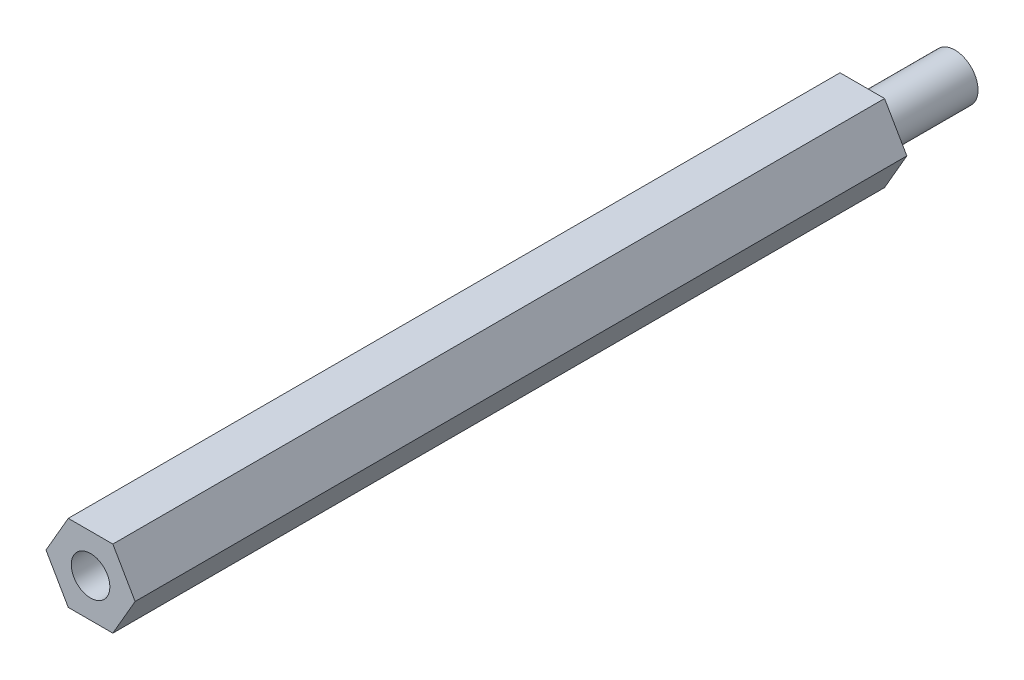
ISO-10303-21;
HEADER;
FILE_DESCRIPTION(('STEP AP214'),'2;1');
FILE_NAME('part.step','',(''),(''),'','','');
FILE_SCHEMA(('AUTOMOTIVE_DESIGN { 1 0 10303 214 1 1 1 1 }'));
ENDSEC;
DATA;
#1=APPLICATION_CONTEXT('core data for automotive mechanical design processes');
#2=APPLICATION_PROTOCOL_DEFINITION('international standard','automotive_design',2000,#1);
#3=PRODUCT_CONTEXT('',#1,'mechanical');
#4=PRODUCT('Part','Part','',(#3));
#5=PRODUCT_RELATED_PRODUCT_CATEGORY('part','',(#4));
#6=PRODUCT_DEFINITION_FORMATION('','',#4);
#7=PRODUCT_DEFINITION_CONTEXT('part definition',#1,'design');
#8=PRODUCT_DEFINITION('design','',#6,#7);
#9=PRODUCT_DEFINITION_SHAPE('','',#8);
#10=(LENGTH_UNIT() NAMED_UNIT(*) SI_UNIT(.MILLI.,.METRE.));
#11=(NAMED_UNIT(*) PLANE_ANGLE_UNIT() SI_UNIT($,.RADIAN.));
#12=(NAMED_UNIT(*) SI_UNIT($,.STERADIAN.) SOLID_ANGLE_UNIT());
#13=UNCERTAINTY_MEASURE_WITH_UNIT(LENGTH_MEASURE(1.E-05),#10,'distance_accuracy_value','');
#14=(GEOMETRIC_REPRESENTATION_CONTEXT(3) GLOBAL_UNCERTAINTY_ASSIGNED_CONTEXT((#13)) GLOBAL_UNIT_ASSIGNED_CONTEXT((#10,
#11,#12)) REPRESENTATION_CONTEXT('',''));
#15=CARTESIAN_POINT('',(0.,0.,0.));
#16=DIRECTION('',(0.,0.,1.));
#17=DIRECTION('',(1.,0.,0.));
#18=AXIS2_PLACEMENT_3D('',#15,#16,#17);
#19=CARTESIAN_POINT('',(1.44337567297406,2.5,50.));
#20=DIRECTION('',(0.,-1.,0.));
#21=DIRECTION('',(1.,0.,0.));
#22=AXIS2_PLACEMENT_3D('',#19,#20,#21);
#23=PLANE('',#22);
#24=DIRECTION('',(-1.,0.,0.));
#25=VECTOR('',#24,1.);
#26=CARTESIAN_POINT('',(1.44337567297406,2.5,0.));
#27=LINE('',#26,#25);
#28=CARTESIAN_POINT('',(1.44337567297406,2.5,0.));
#29=VERTEX_POINT('',#28);
#30=CARTESIAN_POINT('',(-1.44337567297407,2.5,0.));
#31=VERTEX_POINT('',#30);
#32=EDGE_CURVE('E132',#29,#31,#27,.T.);
#33=ORIENTED_EDGE('',*,*,#32,.T.);
#34=DIRECTION('',(0.,0.,-1.));
#35=VECTOR('',#34,1.);
#36=CARTESIAN_POINT('',(-1.44337567297407,2.5,50.));
#37=LINE('',#36,#35);
#38=CARTESIAN_POINT('',(-1.44337567297407,2.5,50.));
#39=VERTEX_POINT('',#38);
#40=EDGE_CURVE('E42',#39,#31,#37,.T.);
#41=ORIENTED_EDGE('',*,*,#40,.F.);
#42=DIRECTION('',(-1.,0.,0.));
#43=VECTOR('',#42,1.);
#44=CARTESIAN_POINT('',(1.44337567297406,2.5,50.));
#45=LINE('',#44,#43);
#46=CARTESIAN_POINT('',(1.44337567297406,2.5,50.));
#47=VERTEX_POINT('',#46);
#48=EDGE_CURVE('E149',#47,#39,#45,.T.);
#49=ORIENTED_EDGE('',*,*,#48,.F.);
#50=DIRECTION('',(0.,0.,-1.));
#51=VECTOR('',#50,1.);
#52=CARTESIAN_POINT('',(1.44337567297406,2.5,50.));
#53=LINE('',#52,#51);
#54=EDGE_CURVE('E128',#47,#29,#53,.T.);
#55=ORIENTED_EDGE('',*,*,#54,.T.);
#56=EDGE_LOOP('',(#33,#41,#49,#55));
#57=FACE_BOUND('',#56,.T.);
#58=ADVANCED_FACE('F39',(#57),#23,.F.);
#59=CARTESIAN_POINT('',(-1.44337567297407,2.5,50.));
#60=DIRECTION('',(0.866025403784439,-0.5,0.));
#61=DIRECTION('',(0.5,0.866025403784439,0.));
#62=AXIS2_PLACEMENT_3D('',#59,#60,#61);
#63=PLANE('',#62);
#64=DIRECTION('',(-0.5,-0.866025403784439,0.));
#65=VECTOR('',#64,1.);
#66=CARTESIAN_POINT('',(-1.44337567297407,2.5,0.));
#67=LINE('',#66,#65);
#68=CARTESIAN_POINT('',(-2.88675134594813,0.,0.));
#69=VERTEX_POINT('',#68);
#70=EDGE_CURVE('E136',#31,#69,#67,.T.);
#71=ORIENTED_EDGE('',*,*,#70,.T.);
#72=DIRECTION('',(0.,0.,-1.));
#73=VECTOR('',#72,1.);
#74=CARTESIAN_POINT('',(-2.88675134594813,0.,50.));
#75=LINE('',#74,#73);
#76=CARTESIAN_POINT('',(-2.88675134594813,0.,50.));
#77=VERTEX_POINT('',#76);
#78=EDGE_CURVE('E155',#77,#69,#75,.T.);
#79=ORIENTED_EDGE('',*,*,#78,.F.);
#80=DIRECTION('',(-0.5,-0.866025403784439,0.));
#81=VECTOR('',#80,1.);
#82=CARTESIAN_POINT('',(-1.44337567297407,2.5,50.));
#83=LINE('',#82,#81);
#84=EDGE_CURVE('E96',#39,#77,#83,.T.);
#85=ORIENTED_EDGE('',*,*,#84,.F.);
#86=ORIENTED_EDGE('',*,*,#40,.T.);
#87=EDGE_LOOP('',(#71,#79,#85,#86));
#88=FACE_BOUND('',#87,.T.);
#89=ADVANCED_FACE('F162',(#88),#63,.F.);
#90=CARTESIAN_POINT('',(-2.88675134594813,0.,50.));
#91=DIRECTION('',(0.866025403784438,0.5,0.));
#92=DIRECTION('',(-0.5,0.866025403784438,0.));
#93=AXIS2_PLACEMENT_3D('',#90,#91,#92);
#94=PLANE('',#93);
#95=DIRECTION('',(0.5,-0.866025403784438,0.));
#96=VECTOR('',#95,1.);
#97=CARTESIAN_POINT('',(-2.88675134594813,0.,0.));
#98=LINE('',#97,#96);
#99=CARTESIAN_POINT('',(-1.44337567297406,-2.5,0.));
#100=VERTEX_POINT('',#99);
#101=EDGE_CURVE('E140',#69,#100,#98,.T.);
#102=ORIENTED_EDGE('',*,*,#101,.T.);
#103=DIRECTION('',(0.,0.,-1.));
#104=VECTOR('',#103,1.);
#105=CARTESIAN_POINT('',(-1.44337567297406,-2.5,50.));
#106=LINE('',#105,#104);
#107=CARTESIAN_POINT('',(-1.44337567297406,-2.5,50.));
#108=VERTEX_POINT('',#107);
#109=EDGE_CURVE('E121',#108,#100,#106,.T.);
#110=ORIENTED_EDGE('',*,*,#109,.F.);
#111=DIRECTION('',(0.5,-0.866025403784438,0.));
#112=VECTOR('',#111,1.);
#113=CARTESIAN_POINT('',(-2.88675134594813,0.,50.));
#114=LINE('',#113,#112);
#115=EDGE_CURVE('E110',#77,#108,#114,.T.);
#116=ORIENTED_EDGE('',*,*,#115,.F.);
#117=ORIENTED_EDGE('',*,*,#78,.T.);
#118=EDGE_LOOP('',(#102,#110,#116,#117));
#119=FACE_BOUND('',#118,.T.);
#120=ADVANCED_FACE('F168',(#119),#94,.F.);
#121=CARTESIAN_POINT('',(-1.44337567297406,-2.5,50.));
#122=DIRECTION('',(0.,1.,0.));
#123=DIRECTION('',(-1.,0.,0.));
#124=AXIS2_PLACEMENT_3D('',#121,#122,#123);
#125=PLANE('',#124);
#126=DIRECTION('',(1.,0.,0.));
#127=VECTOR('',#126,1.);
#128=CARTESIAN_POINT('',(-1.44337567297406,-2.5,0.));
#129=LINE('',#128,#127);
#130=CARTESIAN_POINT('',(1.44337567297407,-2.5,0.));
#131=VERTEX_POINT('',#130);
#132=EDGE_CURVE('E119',#100,#131,#129,.T.);
#133=ORIENTED_EDGE('',*,*,#132,.T.);
#134=DIRECTION('',(0.,0.,-1.));
#135=VECTOR('',#134,1.);
#136=CARTESIAN_POINT('',(1.44337567297407,-2.5,50.));
#137=LINE('',#136,#135);
#138=CARTESIAN_POINT('',(1.44337567297407,-2.5,50.));
#139=VERTEX_POINT('',#138);
#140=EDGE_CURVE('E116',#139,#131,#137,.T.);
#141=ORIENTED_EDGE('',*,*,#140,.F.);
#142=DIRECTION('',(1.,0.,0.));
#143=VECTOR('',#142,1.);
#144=CARTESIAN_POINT('',(-1.44337567297406,-2.5,50.));
#145=LINE('',#144,#143);
#146=EDGE_CURVE('E104',#108,#139,#145,.T.);
#147=ORIENTED_EDGE('',*,*,#146,.F.);
#148=ORIENTED_EDGE('',*,*,#109,.T.);
#149=EDGE_LOOP('',(#133,#141,#147,#148));
#150=FACE_BOUND('',#149,.T.);
#151=ADVANCED_FACE('F117',(#150),#125,.F.);
#152=CARTESIAN_POINT('',(1.44337567297407,-2.5,50.));
#153=DIRECTION('',(-0.866025403784439,0.5,0.));
#154=DIRECTION('',(-0.5,-0.866025403784439,0.));
#155=AXIS2_PLACEMENT_3D('',#152,#153,#154);
#156=PLANE('',#155);
#157=DIRECTION('',(0.5,0.866025403784439,0.));
#158=VECTOR('',#157,1.);
#159=CARTESIAN_POINT('',(1.44337567297407,-2.5,0.));
#160=LINE('',#159,#158);
#161=CARTESIAN_POINT('',(2.88675134594813,0.,0.));
#162=VERTEX_POINT('',#161);
#163=EDGE_CURVE('E81',#131,#162,#160,.T.);
#164=ORIENTED_EDGE('',*,*,#163,.T.);
#165=DIRECTION('',(0.,0.,-1.));
#166=VECTOR('',#165,1.);
#167=CARTESIAN_POINT('',(2.88675134594813,0.,50.));
#168=LINE('',#167,#166);
#169=CARTESIAN_POINT('',(2.88675134594813,0.,50.));
#170=VERTEX_POINT('',#169);
#171=EDGE_CURVE('E122',#170,#162,#168,.T.);
#172=ORIENTED_EDGE('',*,*,#171,.F.);
#173=DIRECTION('',(0.5,0.866025403784439,0.));
#174=VECTOR('',#173,1.);
#175=CARTESIAN_POINT('',(1.44337567297407,-2.5,50.));
#176=LINE('',#175,#174);
#177=EDGE_CURVE('E108',#139,#170,#176,.T.);
#178=ORIENTED_EDGE('',*,*,#177,.F.);
#179=ORIENTED_EDGE('',*,*,#140,.T.);
#180=EDGE_LOOP('',(#164,#172,#178,#179));
#181=FACE_BOUND('',#180,.T.);
#182=ADVANCED_FACE('F124',(#181),#156,.F.);
#183=CARTESIAN_POINT('',(2.88675134594813,0.,50.));
#184=DIRECTION('',(-0.866025403784439,-0.5,0.));
#185=DIRECTION('',(0.5,-0.866025403784439,0.));
#186=AXIS2_PLACEMENT_3D('',#183,#184,#185);
#187=PLANE('',#186);
#188=DIRECTION('',(-0.5,0.866025403784439,0.));
#189=VECTOR('',#188,1.);
#190=CARTESIAN_POINT('',(2.88675134594813,0.,0.));
#191=LINE('',#190,#189);
#192=EDGE_CURVE('E87',#162,#29,#191,.T.);
#193=ORIENTED_EDGE('',*,*,#192,.T.);
#194=ORIENTED_EDGE('',*,*,#54,.F.);
#195=DIRECTION('',(-0.5,0.866025403784439,0.));
#196=VECTOR('',#195,1.);
#197=CARTESIAN_POINT('',(2.88675134594813,0.,50.));
#198=LINE('',#197,#196);
#199=EDGE_CURVE('E57',#170,#47,#198,.T.);
#200=ORIENTED_EDGE('',*,*,#199,.F.);
#201=ORIENTED_EDGE('',*,*,#171,.T.);
#202=EDGE_LOOP('',(#193,#194,#200,#201));
#203=FACE_BOUND('',#202,.T.);
#204=ADVANCED_FACE('F190',(#203),#187,.F.);
#205=CARTESIAN_POINT('',(0.,0.,50.));
#206=DIRECTION('',(0.,0.,1.));
#207=DIRECTION('',(1.,0.,0.));
#208=AXIS2_PLACEMENT_3D('',#205,#206,#207);
#209=PLANE('',#208);
#210=CARTESIAN_POINT('',(0.,0.,50.));
#211=DIRECTION('',(0.,0.,1.));
#212=DIRECTION('',(1.,0.,0.));
#213=AXIS2_PLACEMENT_3D('',#210,#211,#212);
#214=CIRCLE('',#213,1.24999999999999);
#215=CARTESIAN_POINT('',(1.24999999999999,0.,50.));
#216=VERTEX_POINT('',#215);
#217=EDGE_CURVE('E182',#216,#216,#214,.T.);
#218=ORIENTED_EDGE('',*,*,#217,.F.);
#219=EDGE_LOOP('',(#218));
#220=FACE_BOUND('',#219,.T.);
#221=ORIENTED_EDGE('',*,*,#48,.T.);
#222=ORIENTED_EDGE('',*,*,#84,.T.);
#223=ORIENTED_EDGE('',*,*,#115,.T.);
#224=ORIENTED_EDGE('',*,*,#146,.T.);
#225=ORIENTED_EDGE('',*,*,#177,.T.);
#226=ORIENTED_EDGE('',*,*,#199,.T.);
#227=EDGE_LOOP('',(#221,#222,#223,#224,#225,#226));
#228=FACE_BOUND('',#227,.T.);
#229=ADVANCED_FACE('F106',(#220,#228),#209,.T.);
#230=CARTESIAN_POINT('',(0.,0.,0.));
#231=DIRECTION('',(0.,0.,1.));
#232=DIRECTION('',(1.,0.,0.));
#233=AXIS2_PLACEMENT_3D('',#230,#231,#232);
#234=PLANE('',#233);
#235=CARTESIAN_POINT('',(0.,0.,0.));
#236=DIRECTION('',(0.,0.,-1.));
#237=DIRECTION('',(-1.,0.,0.));
#238=AXIS2_PLACEMENT_3D('',#235,#236,#237);
#239=CIRCLE('',#238,1.5);
#240=CARTESIAN_POINT('',(-1.5,0.,0.));
#241=VERTEX_POINT('',#240);
#242=EDGE_CURVE('E11',#241,#241,#239,.T.);
#243=ORIENTED_EDGE('',*,*,#242,.F.);
#244=EDGE_LOOP('',(#243));
#245=FACE_BOUND('',#244,.T.);
#246=ORIENTED_EDGE('',*,*,#32,.F.);
#247=ORIENTED_EDGE('',*,*,#192,.F.);
#248=ORIENTED_EDGE('',*,*,#163,.F.);
#249=ORIENTED_EDGE('',*,*,#132,.F.);
#250=ORIENTED_EDGE('',*,*,#101,.F.);
#251=ORIENTED_EDGE('',*,*,#70,.F.);
#252=EDGE_LOOP('',(#246,#247,#248,#249,#250,#251));
#253=FACE_BOUND('',#252,.T.);
#254=ADVANCED_FACE('F167',(#245,#253),#234,.F.);
#255=CARTESIAN_POINT('',(0.,0.,-6.));
#256=DIRECTION('',(0.,0.,1.));
#257=DIRECTION('',(1.,0.,0.));
#258=AXIS2_PLACEMENT_3D('',#255,#256,#257);
#259=CYLINDRICAL_SURFACE('',#258,1.5);
#260=CARTESIAN_POINT('',(0.,0.,-6.));
#261=DIRECTION('',(0.,0.,-1.));
#262=DIRECTION('',(-1.,0.,0.));
#263=AXIS2_PLACEMENT_3D('',#260,#261,#262);
#264=CIRCLE('',#263,1.5);
#265=CARTESIAN_POINT('',(-1.5,0.,-6.));
#266=VERTEX_POINT('',#265);
#267=EDGE_CURVE('E137',#266,#266,#264,.T.);
#268=ORIENTED_EDGE('',*,*,#267,.F.);
#269=EDGE_LOOP('',(#268));
#270=FACE_BOUND('',#269,.T.);
#271=ORIENTED_EDGE('',*,*,#242,.T.);
#272=EDGE_LOOP('',(#271));
#273=FACE_BOUND('',#272,.T.);
#274=ADVANCED_FACE('F196',(#270,#273),#259,.T.);
#275=CARTESIAN_POINT('',(0.,0.,-6.));
#276=DIRECTION('',(0.,0.,-1.));
#277=DIRECTION('',(-1.,0.,0.));
#278=AXIS2_PLACEMENT_3D('',#275,#276,#277);
#279=PLANE('',#278);
#280=ORIENTED_EDGE('',*,*,#267,.T.);
#281=EDGE_LOOP('',(#280));
#282=FACE_BOUND('',#281,.T.);
#283=ADVANCED_FACE('F237',(#282),#279,.T.);
#284=CARTESIAN_POINT('',(0.,0.,42.5));
#285=DIRECTION('',(0.,0.,1.));
#286=DIRECTION('',(1.,0.,0.));
#287=AXIS2_PLACEMENT_3D('',#284,#285,#286);
#288=CONICAL_SURFACE('',#287,1.25,1.02974425867665);
#289=CARTESIAN_POINT('',(0.,0.,41.7489242262155));
#290=VERTEX_POINT('',#289);
#291=VERTEX_LOOP('',#290);
#292=FACE_BOUND('',#291,.T.);
#293=CARTESIAN_POINT('',(0.,0.,42.5));
#294=DIRECTION('',(0.,0.,1.));
#295=DIRECTION('',(1.,0.,0.));
#296=AXIS2_PLACEMENT_3D('',#293,#294,#295);
#297=CIRCLE('',#296,1.25);
#298=CARTESIAN_POINT('',(1.25,0.,42.5));
#299=VERTEX_POINT('',#298);
#300=EDGE_CURVE('E178',#299,#299,#297,.T.);
#301=ORIENTED_EDGE('',*,*,#300,.T.);
#302=EDGE_LOOP('',(#301));
#303=FACE_BOUND('',#302,.T.);
#304=ADVANCED_FACE('F245',(#292,#303),#288,.F.);
#305=CARTESIAN_POINT('',(0.,0.,50.));
#306=DIRECTION('',(0.,0.,1.));
#307=DIRECTION('',(1.,0.,0.));
#308=AXIS2_PLACEMENT_3D('',#305,#306,#307);
#309=CYLINDRICAL_SURFACE('',#308,1.24999999999999);
#310=ORIENTED_EDGE('',*,*,#300,.F.);
#311=EDGE_LOOP('',(#310));
#312=FACE_BOUND('',#311,.T.);
#313=ORIENTED_EDGE('',*,*,#217,.T.);
#314=EDGE_LOOP('',(#313));
#315=FACE_BOUND('',#314,.T.);
#316=ADVANCED_FACE('F187',(#312,#315),#309,.F.);
#317=CLOSED_SHELL('',(#58,#89,#120,#151,#182,#204,#229,#254,#274,#283,#304,#316));
#318=MANIFOLD_SOLID_BREP('B2',#317);
#319=ADVANCED_BREP_SHAPE_REPRESENTATION('',(#18,#318),#14);
#320=SHAPE_DEFINITION_REPRESENTATION(#9,#319);
ENDSEC;
END-ISO-10303-21;
